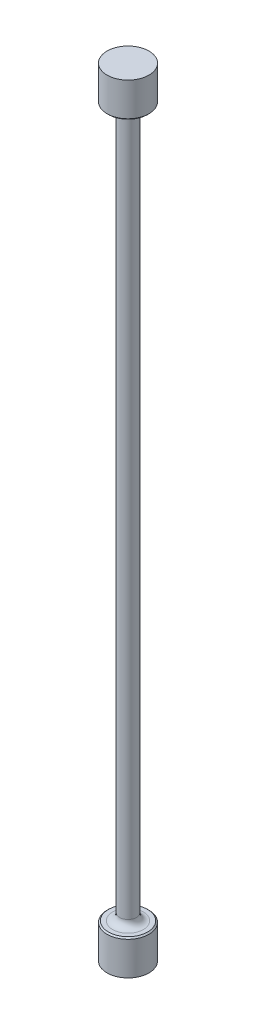
ISO-10303-21;
HEADER;
FILE_DESCRIPTION(('STEP AP214'),'2;1');
FILE_NAME('part.step','',(''),(''),'','','');
FILE_SCHEMA(('AUTOMOTIVE_DESIGN { 1 0 10303 214 1 1 1 1 }'));
ENDSEC;
DATA;
#1=APPLICATION_CONTEXT('core data for automotive mechanical design processes');
#2=APPLICATION_PROTOCOL_DEFINITION('international standard','automotive_design',2000,#1);
#3=PRODUCT_CONTEXT('',#1,'mechanical');
#4=PRODUCT('Part','Part','',(#3));
#5=PRODUCT_RELATED_PRODUCT_CATEGORY('part','',(#4));
#6=PRODUCT_DEFINITION_FORMATION('','',#4);
#7=PRODUCT_DEFINITION_CONTEXT('part definition',#1,'design');
#8=PRODUCT_DEFINITION('design','',#6,#7);
#9=PRODUCT_DEFINITION_SHAPE('','',#8);
#10=(LENGTH_UNIT() NAMED_UNIT(*) SI_UNIT(.MILLI.,.METRE.));
#11=(NAMED_UNIT(*) PLANE_ANGLE_UNIT() SI_UNIT($,.RADIAN.));
#12=(NAMED_UNIT(*) SI_UNIT($,.STERADIAN.) SOLID_ANGLE_UNIT());
#13=UNCERTAINTY_MEASURE_WITH_UNIT(LENGTH_MEASURE(1.E-05),#10,'distance_accuracy_value','');
#14=(GEOMETRIC_REPRESENTATION_CONTEXT(3) GLOBAL_UNCERTAINTY_ASSIGNED_CONTEXT((#13)) GLOBAL_UNIT_ASSIGNED_CONTEXT((#10,
#11,#12)) REPRESENTATION_CONTEXT('',''));
#15=CARTESIAN_POINT('',(0.,0.,0.));
#16=DIRECTION('',(0.,0.,1.));
#17=DIRECTION('',(1.,0.,0.));
#18=AXIS2_PLACEMENT_3D('',#15,#16,#17);
#19=CARTESIAN_POINT('',(6.,-101.618928002608,0.));
#20=DIRECTION('',(0.,1.,0.));
#21=DIRECTION('',(0.,0.,1.));
#22=AXIS2_PLACEMENT_3D('',#19,#20,#21);
#23=PLANE('',#22);
#24=CARTESIAN_POINT('',(0.,-101.618928002608,0.));
#25=DIRECTION('',(0.,1.,0.));
#26=DIRECTION('',(0.,0.,1.));
#27=AXIS2_PLACEMENT_3D('',#24,#25,#26);
#28=CIRCLE('',#27,5.61900000000001);
#29=CARTESIAN_POINT('',(0.,-101.618928002608,5.61900000000001));
#30=VERTEX_POINT('',#29);
#31=EDGE_CURVE('E49',#30,#30,#28,.T.);
#32=ORIENTED_EDGE('',*,*,#31,.T.);
#33=EDGE_LOOP('',(#32));
#34=FACE_BOUND('',#33,.T.);
#35=CARTESIAN_POINT('',(0.,-101.618928002608,0.));
#36=DIRECTION('',(0.,1.,0.));
#37=DIRECTION('',(0.,0.,1.));
#38=AXIS2_PLACEMENT_3D('',#35,#36,#37);
#39=CIRCLE('',#38,4.40000000000002);
#40=CARTESIAN_POINT('',(0.,-101.618928002608,4.40000000000002));
#41=VERTEX_POINT('',#40);
#42=EDGE_CURVE('E67',#41,#41,#39,.F.);
#43=ORIENTED_EDGE('',*,*,#42,.T.);
#44=EDGE_LOOP('',(#43));
#45=FACE_BOUND('',#44,.T.);
#46=ADVANCED_FACE('F38',(#34,#45),#23,.T.);
#47=CARTESIAN_POINT('',(0.,0.,0.));
#48=DIRECTION('',(0.,-1.,0.));
#49=DIRECTION('',(0.,0.,-1.));
#50=AXIS2_PLACEMENT_3D('',#47,#48,#49);
#51=CYLINDRICAL_SURFACE('',#50,2.40000000000002);
#52=CARTESIAN_POINT('',(0.,-99.6189280026083,0.));
#53=DIRECTION('',(0.,1.,0.));
#54=DIRECTION('',(0.,0.,1.));
#55=AXIS2_PLACEMENT_3D('',#52,#53,#54);
#56=CIRCLE('',#55,2.40000000000002);
#57=CARTESIAN_POINT('',(0.,-99.6189280026083,2.40000000000002));
#58=VERTEX_POINT('',#57);
#59=EDGE_CURVE('E61',#58,#58,#56,.T.);
#60=ORIENTED_EDGE('',*,*,#59,.T.);
#61=EDGE_LOOP('',(#60));
#62=FACE_BOUND('',#61,.T.);
#63=CARTESIAN_POINT('',(0.,99.6189280026083,0.));
#64=DIRECTION('',(0.,-1.,0.));
#65=DIRECTION('',(0.,0.,-1.));
#66=AXIS2_PLACEMENT_3D('',#63,#64,#65);
#67=CIRCLE('',#66,2.40000000000002);
#68=CARTESIAN_POINT('',(0.,99.6189280026083,-2.40000000000002));
#69=VERTEX_POINT('',#68);
#70=EDGE_CURVE('E64',#69,#69,#67,.T.);
#71=ORIENTED_EDGE('',*,*,#70,.T.);
#72=EDGE_LOOP('',(#71));
#73=FACE_BOUND('',#72,.T.);
#74=ADVANCED_FACE('F94',(#62,#73),#51,.T.);
#75=CARTESIAN_POINT('',(6.,101.618928002608,0.));
#76=DIRECTION('',(0.,-1.,0.));
#77=DIRECTION('',(0.,0.,-1.));
#78=AXIS2_PLACEMENT_3D('',#75,#76,#77);
#79=PLANE('',#78);
#80=CARTESIAN_POINT('',(0.,101.618928002608,0.));
#81=DIRECTION('',(0.,-1.,0.));
#82=DIRECTION('',(0.,0.,-1.));
#83=AXIS2_PLACEMENT_3D('',#80,#81,#82);
#84=CIRCLE('',#83,5.61899999999993);
#85=CARTESIAN_POINT('',(0.,101.618928002608,-5.61899999999993));
#86=VERTEX_POINT('',#85);
#87=EDGE_CURVE('E45',#86,#86,#84,.T.);
#88=ORIENTED_EDGE('',*,*,#87,.T.);
#89=EDGE_LOOP('',(#88));
#90=FACE_BOUND('',#89,.T.);
#91=CARTESIAN_POINT('',(0.,101.618928002608,0.));
#92=DIRECTION('',(0.,-1.,0.));
#93=DIRECTION('',(0.,0.,-1.));
#94=AXIS2_PLACEMENT_3D('',#91,#92,#93);
#95=CIRCLE('',#94,4.40000000000002);
#96=CARTESIAN_POINT('',(0.,101.618928002608,-4.40000000000002));
#97=VERTEX_POINT('',#96);
#98=EDGE_CURVE('E58',#97,#97,#95,.F.);
#99=ORIENTED_EDGE('',*,*,#98,.T.);
#100=EDGE_LOOP('',(#99));
#101=FACE_BOUND('',#100,.T.);
#102=ADVANCED_FACE('F100',(#90,#101),#79,.T.);
#103=CARTESIAN_POINT('',(0.,0.,0.));
#104=DIRECTION('',(0.,-1.,0.));
#105=DIRECTION('',(0.,0.,-1.));
#106=AXIS2_PLACEMENT_3D('',#103,#104,#105);
#107=CYLINDRICAL_SURFACE('',#106,6.);
#108=CARTESIAN_POINT('',(0.,101.999928002608,0.));
#109=DIRECTION('',(0.,-1.,0.));
#110=DIRECTION('',(0.,0.,-1.));
#111=AXIS2_PLACEMENT_3D('',#108,#109,#110);
#112=CIRCLE('',#111,6.);
#113=CARTESIAN_POINT('',(0.,101.999928002608,-6.));
#114=VERTEX_POINT('',#113);
#115=EDGE_CURVE('E10',#114,#114,#112,.F.);
#116=ORIENTED_EDGE('',*,*,#115,.T.);
#117=EDGE_LOOP('',(#116));
#118=FACE_BOUND('',#117,.T.);
#119=CARTESIAN_POINT('',(0.,111.618928002608,0.));
#120=DIRECTION('',(0.,-1.,0.));
#121=DIRECTION('',(0.,0.,-1.));
#122=AXIS2_PLACEMENT_3D('',#119,#120,#121);
#123=CIRCLE('',#122,6.);
#124=CARTESIAN_POINT('',(0.,111.618928002608,-6.));
#125=VERTEX_POINT('',#124);
#126=EDGE_CURVE('E70',#125,#125,#123,.T.);
#127=ORIENTED_EDGE('',*,*,#126,.T.);
#128=EDGE_LOOP('',(#127));
#129=FACE_BOUND('',#128,.T.);
#130=ADVANCED_FACE('F152',(#118,#129),#107,.T.);
#131=CARTESIAN_POINT('',(0.,111.618928002608,0.));
#132=DIRECTION('',(0.,1.,0.));
#133=DIRECTION('',(0.,0.,1.));
#134=AXIS2_PLACEMENT_3D('',#131,#132,#133);
#135=PLANE('',#134);
#136=ORIENTED_EDGE('',*,*,#126,.F.);
#137=EDGE_LOOP('',(#136));
#138=FACE_BOUND('',#137,.T.);
#139=ADVANCED_FACE('F91',(#138),#135,.T.);
#140=CARTESIAN_POINT('',(0.,-111.618928002608,0.));
#141=DIRECTION('',(0.,-1.,0.));
#142=DIRECTION('',(0.,0.,-1.));
#143=AXIS2_PLACEMENT_3D('',#140,#141,#142);
#144=PLANE('',#143);
#145=CARTESIAN_POINT('',(0.,-111.618928002608,0.));
#146=DIRECTION('',(0.,-1.,0.));
#147=DIRECTION('',(0.,0.,-1.));
#148=AXIS2_PLACEMENT_3D('',#145,#146,#147);
#149=CIRCLE('',#148,6.);
#150=CARTESIAN_POINT('',(0.,-111.618928002608,-6.));
#151=VERTEX_POINT('',#150);
#152=EDGE_CURVE('E73',#151,#151,#149,.T.);
#153=ORIENTED_EDGE('',*,*,#152,.T.);
#154=EDGE_LOOP('',(#153));
#155=FACE_BOUND('',#154,.T.);
#156=ADVANCED_FACE('F77',(#155),#144,.T.);
#157=CARTESIAN_POINT('',(0.,0.,0.));
#158=DIRECTION('',(0.,-1.,0.));
#159=DIRECTION('',(0.,0.,-1.));
#160=AXIS2_PLACEMENT_3D('',#157,#158,#159);
#161=CYLINDRICAL_SURFACE('',#160,6.);
#162=CARTESIAN_POINT('',(0.,-101.999928002608,0.));
#163=DIRECTION('',(0.,1.,0.));
#164=DIRECTION('',(0.,0.,1.));
#165=AXIS2_PLACEMENT_3D('',#162,#163,#164);
#166=CIRCLE('',#165,6.);
#167=CARTESIAN_POINT('',(0.,-101.999928002608,6.));
#168=VERTEX_POINT('',#167);
#169=EDGE_CURVE('E53',#168,#168,#166,.F.);
#170=ORIENTED_EDGE('',*,*,#169,.T.);
#171=EDGE_LOOP('',(#170));
#172=FACE_BOUND('',#171,.T.);
#173=ORIENTED_EDGE('',*,*,#152,.F.);
#174=EDGE_LOOP('',(#173));
#175=FACE_BOUND('',#174,.T.);
#176=ADVANCED_FACE('F79',(#172,#175),#161,.T.);
#177=CARTESIAN_POINT('',(0.,-99.6189280026083,0.));
#178=DIRECTION('',(0.,1.,0.));
#179=DIRECTION('',(0.,0.,1.));
#180=AXIS2_PLACEMENT_3D('',#177,#178,#179);
#181=TOROIDAL_SURFACE('',#180,4.40000000000002,2.);
#182=ORIENTED_EDGE('',*,*,#59,.F.);
#183=EDGE_LOOP('',(#182));
#184=FACE_BOUND('',#183,.T.);
#185=ORIENTED_EDGE('',*,*,#42,.F.);
#186=EDGE_LOOP('',(#185));
#187=FACE_BOUND('',#186,.T.);
#188=ADVANCED_FACE('F81',(#184,#187),#181,.F.);
#189=CARTESIAN_POINT('',(0.,99.6189280026083,0.));
#190=DIRECTION('',(0.,-1.,0.));
#191=DIRECTION('',(0.,0.,-1.));
#192=AXIS2_PLACEMENT_3D('',#189,#190,#191);
#193=TOROIDAL_SURFACE('',#192,4.40000000000002,2.);
#194=ORIENTED_EDGE('',*,*,#98,.F.);
#195=EDGE_LOOP('',(#194));
#196=FACE_BOUND('',#195,.T.);
#197=ORIENTED_EDGE('',*,*,#70,.F.);
#198=EDGE_LOOP('',(#197));
#199=FACE_BOUND('',#198,.T.);
#200=ADVANCED_FACE('F88',(#196,#199),#193,.F.);
#201=CARTESIAN_POINT('',(0.,-101.999928002608,0.));
#202=DIRECTION('',(0.,-1.,0.));
#203=DIRECTION('',(0.,0.,-1.));
#204=AXIS2_PLACEMENT_3D('',#201,#202,#203);
#205=CONICAL_SURFACE('',#204,6.,0.785398163397423);
#206=ORIENTED_EDGE('',*,*,#31,.F.);
#207=EDGE_LOOP('',(#206));
#208=FACE_BOUND('',#207,.T.);
#209=ORIENTED_EDGE('',*,*,#169,.F.);
#210=EDGE_LOOP('',(#209));
#211=FACE_BOUND('',#210,.T.);
#212=ADVANCED_FACE('F107',(#208,#211),#205,.T.);
#213=CARTESIAN_POINT('',(0.,101.618928002608,0.));
#214=DIRECTION('',(0.,1.,0.));
#215=DIRECTION('',(0.,0.,1.));
#216=AXIS2_PLACEMENT_3D('',#213,#214,#215);
#217=CONICAL_SURFACE('',#216,5.61899999999993,0.785398163397442);
#218=ORIENTED_EDGE('',*,*,#115,.F.);
#219=EDGE_LOOP('',(#218));
#220=FACE_BOUND('',#219,.T.);
#221=ORIENTED_EDGE('',*,*,#87,.F.);
#222=EDGE_LOOP('',(#221));
#223=FACE_BOUND('',#222,.T.);
#224=ADVANCED_FACE('F40',(#220,#223),#217,.T.);
#225=CLOSED_SHELL('',(#46,#74,#102,#130,#139,#156,#176,#188,#200,#212,#224));
#226=MANIFOLD_SOLID_BREP('B2',#225);
#227=ADVANCED_BREP_SHAPE_REPRESENTATION('',(#18,#226),#14);
#228=SHAPE_DEFINITION_REPRESENTATION(#9,#227);
ENDSEC;
END-ISO-10303-21;
